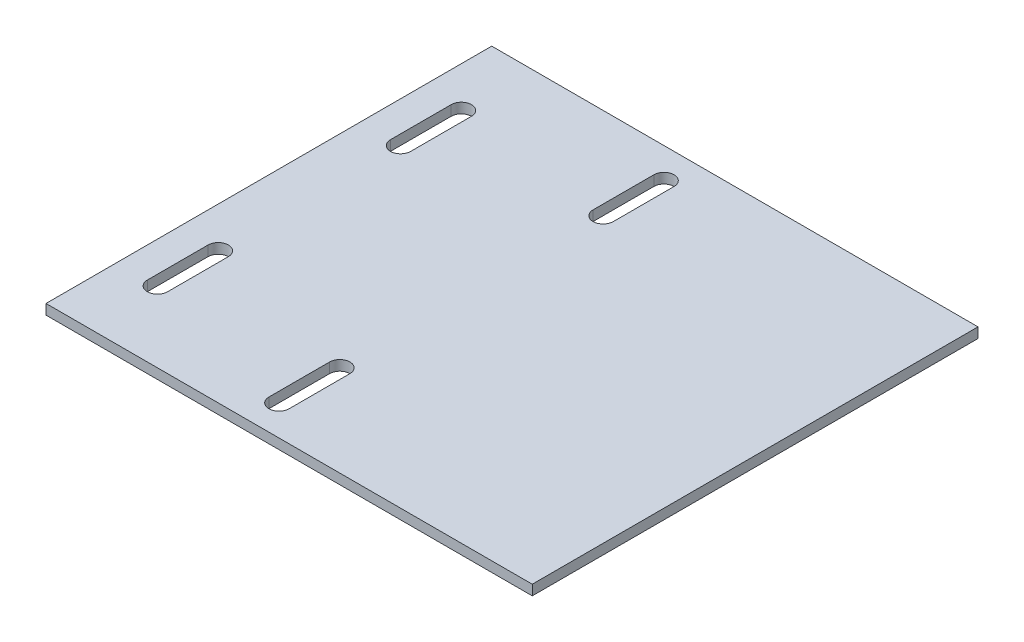
ISO-10303-21;
HEADER;
FILE_DESCRIPTION(('STEP AP214'),'2;1');
FILE_NAME('part.step','',(''),(''),'','','');
FILE_SCHEMA(('AUTOMOTIVE_DESIGN { 1 0 10303 214 1 1 1 1 }'));
ENDSEC;
DATA;
#1=APPLICATION_CONTEXT('core data for automotive mechanical design processes');
#2=APPLICATION_PROTOCOL_DEFINITION('international standard','automotive_design',2000,#1);
#3=PRODUCT_CONTEXT('',#1,'mechanical');
#4=PRODUCT('Part','Part','',(#3));
#5=PRODUCT_RELATED_PRODUCT_CATEGORY('part','',(#4));
#6=PRODUCT_DEFINITION_FORMATION('','',#4);
#7=PRODUCT_DEFINITION_CONTEXT('part definition',#1,'design');
#8=PRODUCT_DEFINITION('design','',#6,#7);
#9=PRODUCT_DEFINITION_SHAPE('','',#8);
#10=(LENGTH_UNIT() NAMED_UNIT(*) SI_UNIT(.MILLI.,.METRE.));
#11=(NAMED_UNIT(*) PLANE_ANGLE_UNIT() SI_UNIT($,.RADIAN.));
#12=(NAMED_UNIT(*) SI_UNIT($,.STERADIAN.) SOLID_ANGLE_UNIT());
#13=UNCERTAINTY_MEASURE_WITH_UNIT(LENGTH_MEASURE(1.E-05),#10,'distance_accuracy_value','');
#14=(GEOMETRIC_REPRESENTATION_CONTEXT(3) GLOBAL_UNCERTAINTY_ASSIGNED_CONTEXT((#13)) GLOBAL_UNIT_ASSIGNED_CONTEXT((#10,
#11,#12)) REPRESENTATION_CONTEXT('',''));
#15=CARTESIAN_POINT('',(0.,0.,0.));
#16=DIRECTION('',(0.,0.,1.));
#17=DIRECTION('',(1.,0.,0.));
#18=AXIS2_PLACEMENT_3D('',#15,#16,#17);
#19=CARTESIAN_POINT('',(-76.2,3.175,-69.85));
#20=DIRECTION('',(1.,0.,0.));
#21=DIRECTION('',(0.,0.,-1.));
#22=AXIS2_PLACEMENT_3D('',#19,#20,#21);
#23=PLANE('',#22);
#24=DIRECTION('',(0.,0.,1.));
#25=VECTOR('',#24,1.);
#26=CARTESIAN_POINT('',(-76.2,0.,-69.85));
#27=LINE('',#26,#25);
#28=CARTESIAN_POINT('',(-76.2,0.,-69.85));
#29=VERTEX_POINT('',#28);
#30=CARTESIAN_POINT('',(-76.2,0.,69.85));
#31=VERTEX_POINT('',#30);
#32=EDGE_CURVE('E298',#29,#31,#27,.T.);
#33=ORIENTED_EDGE('',*,*,#32,.T.);
#34=DIRECTION('',(0.,-1.,0.));
#35=VECTOR('',#34,1.);
#36=CARTESIAN_POINT('',(-76.2,3.175,69.85));
#37=LINE('',#36,#35);
#38=CARTESIAN_POINT('',(-76.2,3.175,69.85));
#39=VERTEX_POINT('',#38);
#40=EDGE_CURVE('E11',#39,#31,#37,.T.);
#41=ORIENTED_EDGE('',*,*,#40,.F.);
#42=DIRECTION('',(0.,0.,1.));
#43=VECTOR('',#42,1.);
#44=CARTESIAN_POINT('',(-76.2,3.175,-69.85));
#45=LINE('',#44,#43);
#46=CARTESIAN_POINT('',(-76.2,3.175,-69.85));
#47=VERTEX_POINT('',#46);
#48=EDGE_CURVE('E305',#47,#39,#45,.T.);
#49=ORIENTED_EDGE('',*,*,#48,.F.);
#50=DIRECTION('',(0.,-1.,0.));
#51=VECTOR('',#50,1.);
#52=CARTESIAN_POINT('',(-76.2,3.175,-69.85));
#53=LINE('',#52,#51);
#54=EDGE_CURVE('E316',#47,#29,#53,.T.);
#55=ORIENTED_EDGE('',*,*,#54,.T.);
#56=EDGE_LOOP('',(#33,#41,#49,#55));
#57=FACE_BOUND('',#56,.T.);
#58=ADVANCED_FACE('F37',(#57),#23,.F.);
#59=CARTESIAN_POINT('',(76.2,3.175,69.85));
#60=DIRECTION('',(0.,0.,-1.));
#61=DIRECTION('',(-1.,0.,0.));
#62=AXIS2_PLACEMENT_3D('',#59,#60,#61);
#63=PLANE('',#62);
#64=DIRECTION('',(1.,0.,0.));
#65=VECTOR('',#64,1.);
#66=CARTESIAN_POINT('',(76.2,0.,69.85));
#67=LINE('',#66,#65);
#68=CARTESIAN_POINT('',(76.2,0.,69.85));
#69=VERTEX_POINT('',#68);
#70=EDGE_CURVE('E319',#31,#69,#67,.T.);
#71=ORIENTED_EDGE('',*,*,#70,.T.);
#72=DIRECTION('',(0.,-1.,0.));
#73=VECTOR('',#72,1.);
#74=CARTESIAN_POINT('',(76.2,3.175,69.85));
#75=LINE('',#74,#73);
#76=CARTESIAN_POINT('',(76.2,3.175,69.85));
#77=VERTEX_POINT('',#76);
#78=EDGE_CURVE('E44',#77,#69,#75,.T.);
#79=ORIENTED_EDGE('',*,*,#78,.F.);
#80=DIRECTION('',(1.,0.,0.));
#81=VECTOR('',#80,1.);
#82=CARTESIAN_POINT('',(76.2,3.175,69.85));
#83=LINE('',#82,#81);
#84=EDGE_CURVE('E308',#39,#77,#83,.T.);
#85=ORIENTED_EDGE('',*,*,#84,.F.);
#86=ORIENTED_EDGE('',*,*,#40,.T.);
#87=EDGE_LOOP('',(#71,#79,#85,#86));
#88=FACE_BOUND('',#87,.T.);
#89=ADVANCED_FACE('F349',(#88),#63,.F.);
#90=CARTESIAN_POINT('',(76.2,3.175,-69.85));
#91=DIRECTION('',(-1.,0.,0.));
#92=DIRECTION('',(0.,0.,1.));
#93=AXIS2_PLACEMENT_3D('',#90,#91,#92);
#94=PLANE('',#93);
#95=DIRECTION('',(0.,0.,-1.));
#96=VECTOR('',#95,1.);
#97=CARTESIAN_POINT('',(76.2,0.,-69.85));
#98=LINE('',#97,#96);
#99=CARTESIAN_POINT('',(76.2,0.,-69.85));
#100=VERTEX_POINT('',#99);
#101=EDGE_CURVE('E322',#69,#100,#98,.T.);
#102=ORIENTED_EDGE('',*,*,#101,.T.);
#103=DIRECTION('',(0.,-1.,0.));
#104=VECTOR('',#103,1.);
#105=CARTESIAN_POINT('',(76.2,3.175,-69.85));
#106=LINE('',#105,#104);
#107=CARTESIAN_POINT('',(76.2,3.175,-69.85));
#108=VERTEX_POINT('',#107);
#109=EDGE_CURVE('E327',#108,#100,#106,.T.);
#110=ORIENTED_EDGE('',*,*,#109,.F.);
#111=DIRECTION('',(0.,0.,-1.));
#112=VECTOR('',#111,1.);
#113=CARTESIAN_POINT('',(76.2,3.175,-69.85));
#114=LINE('',#113,#112);
#115=EDGE_CURVE('E312',#77,#108,#114,.T.);
#116=ORIENTED_EDGE('',*,*,#115,.F.);
#117=ORIENTED_EDGE('',*,*,#78,.T.);
#118=EDGE_LOOP('',(#102,#110,#116,#117));
#119=FACE_BOUND('',#118,.T.);
#120=ADVANCED_FACE('F334',(#119),#94,.F.);
#121=CARTESIAN_POINT('',(76.2,3.175,-69.85));
#122=DIRECTION('',(0.,0.,1.));
#123=DIRECTION('',(1.,0.,0.));
#124=AXIS2_PLACEMENT_3D('',#121,#122,#123);
#125=PLANE('',#124);
#126=DIRECTION('',(-1.,0.,0.));
#127=VECTOR('',#126,1.);
#128=CARTESIAN_POINT('',(76.2,0.,-69.85));
#129=LINE('',#128,#127);
#130=EDGE_CURVE('E309',#100,#29,#129,.T.);
#131=ORIENTED_EDGE('',*,*,#130,.T.);
#132=ORIENTED_EDGE('',*,*,#54,.F.);
#133=DIRECTION('',(-1.,0.,0.));
#134=VECTOR('',#133,1.);
#135=CARTESIAN_POINT('',(76.2,3.175,-69.85));
#136=LINE('',#135,#134);
#137=EDGE_CURVE('E314',#108,#47,#136,.T.);
#138=ORIENTED_EDGE('',*,*,#137,.F.);
#139=ORIENTED_EDGE('',*,*,#109,.T.);
#140=EDGE_LOOP('',(#131,#132,#138,#139));
#141=FACE_BOUND('',#140,.T.);
#142=ADVANCED_FACE('F342',(#141),#125,.F.);
#143=CARTESIAN_POINT('',(-76.1999999999999,3.175,69.85));
#144=DIRECTION('',(0.,-1.,0.));
#145=DIRECTION('',(0.,0.,-1.));
#146=AXIS2_PLACEMENT_3D('',#143,#144,#145);
#147=PLANE('',#146);
#148=CARTESIAN_POINT('',(-63.5,3.175,-28.575));
#149=DIRECTION('',(0.,1.,0.));
#150=DIRECTION('',(0.,0.,1.));
#151=AXIS2_PLACEMENT_3D('',#148,#149,#150);
#152=CIRCLE('',#151,3.175);
#153=CARTESIAN_POINT('',(-66.675,3.175,-28.575));
#154=VERTEX_POINT('',#153);
#155=CARTESIAN_POINT('',(-60.325,3.175,-28.575));
#156=VERTEX_POINT('',#155);
#157=EDGE_CURVE('E199',#154,#156,#152,.T.);
#158=ORIENTED_EDGE('',*,*,#157,.F.);
#159=DIRECTION('',(0.,0.,1.));
#160=VECTOR('',#159,1.);
#161=CARTESIAN_POINT('',(-66.675,3.175,0.));
#162=LINE('',#161,#160);
#163=CARTESIAN_POINT('',(-66.675,3.175,-47.625));
#164=VERTEX_POINT('',#163);
#165=EDGE_CURVE('E51',#164,#154,#162,.T.);
#166=ORIENTED_EDGE('',*,*,#165,.F.);
#167=CARTESIAN_POINT('',(-63.5,3.175,-47.625));
#168=DIRECTION('',(0.,1.,0.));
#169=DIRECTION('',(0.,0.,1.));
#170=AXIS2_PLACEMENT_3D('',#167,#168,#169);
#171=CIRCLE('',#170,3.17499999999999);
#172=CARTESIAN_POINT('',(-60.325,3.175,-47.625));
#173=VERTEX_POINT('',#172);
#174=EDGE_CURVE('E190',#173,#164,#171,.T.);
#175=ORIENTED_EDGE('',*,*,#174,.F.);
#176=DIRECTION('',(0.,0.,1.));
#177=VECTOR('',#176,1.);
#178=CARTESIAN_POINT('',(-60.325,3.175,0.));
#179=LINE('',#178,#177);
#180=EDGE_CURVE('E193',#173,#156,#179,.T.);
#181=ORIENTED_EDGE('',*,*,#180,.T.);
#182=EDGE_LOOP('',(#158,#166,#175,#181));
#183=FACE_BOUND('',#182,.T.);
#184=CARTESIAN_POINT('',(-63.5,3.175,47.625));
#185=DIRECTION('',(0.,1.,0.));
#186=DIRECTION('',(0.,0.,1.));
#187=AXIS2_PLACEMENT_3D('',#184,#185,#186);
#188=CIRCLE('',#187,3.175);
#189=CARTESIAN_POINT('',(-66.675,3.175,47.625));
#190=VERTEX_POINT('',#189);
#191=CARTESIAN_POINT('',(-60.325,3.175,47.625));
#192=VERTEX_POINT('',#191);
#193=EDGE_CURVE('E224',#190,#192,#188,.T.);
#194=ORIENTED_EDGE('',*,*,#193,.F.);
#195=DIRECTION('',(0.,0.,1.));
#196=VECTOR('',#195,1.);
#197=CARTESIAN_POINT('',(-66.675,3.175,0.));
#198=LINE('',#197,#196);
#199=CARTESIAN_POINT('',(-66.675,3.175,28.575));
#200=VERTEX_POINT('',#199);
#201=EDGE_CURVE('E205',#200,#190,#198,.T.);
#202=ORIENTED_EDGE('',*,*,#201,.F.);
#203=CARTESIAN_POINT('',(-63.5,3.175,28.575));
#204=DIRECTION('',(0.,1.,0.));
#205=DIRECTION('',(0.,0.,1.));
#206=AXIS2_PLACEMENT_3D('',#203,#204,#205);
#207=CIRCLE('',#206,3.175);
#208=CARTESIAN_POINT('',(-60.325,3.175,28.575));
#209=VERTEX_POINT('',#208);
#210=EDGE_CURVE('E213',#209,#200,#207,.T.);
#211=ORIENTED_EDGE('',*,*,#210,.F.);
#212=DIRECTION('',(0.,0.,1.));
#213=VECTOR('',#212,1.);
#214=CARTESIAN_POINT('',(-60.325,3.175,0.));
#215=LINE('',#214,#213);
#216=EDGE_CURVE('E227',#209,#192,#215,.T.);
#217=ORIENTED_EDGE('',*,*,#216,.T.);
#218=EDGE_LOOP('',(#194,#202,#211,#217));
#219=FACE_BOUND('',#218,.T.);
#220=CARTESIAN_POINT('',(-12.7,3.175,-60.325));
#221=DIRECTION('',(0.,1.,0.));
#222=DIRECTION('',(0.,0.,1.));
#223=AXIS2_PLACEMENT_3D('',#220,#221,#222);
#224=CIRCLE('',#223,3.175);
#225=CARTESIAN_POINT('',(-9.52500000000001,3.175,-60.325));
#226=VERTEX_POINT('',#225);
#227=CARTESIAN_POINT('',(-15.875,3.175,-60.325));
#228=VERTEX_POINT('',#227);
#229=EDGE_CURVE('E256',#226,#228,#224,.T.);
#230=ORIENTED_EDGE('',*,*,#229,.F.);
#231=DIRECTION('',(0.,0.,-1.));
#232=VECTOR('',#231,1.);
#233=CARTESIAN_POINT('',(-9.52500000000001,3.175,0.));
#234=LINE('',#233,#232);
#235=CARTESIAN_POINT('',(-9.52500000000001,3.175,-41.275));
#236=VERTEX_POINT('',#235);
#237=EDGE_CURVE('E234',#236,#226,#234,.T.);
#238=ORIENTED_EDGE('',*,*,#237,.F.);
#239=CARTESIAN_POINT('',(-12.7,3.175,-41.275));
#240=DIRECTION('',(0.,1.,0.));
#241=DIRECTION('',(0.,0.,1.));
#242=AXIS2_PLACEMENT_3D('',#239,#240,#241);
#243=CIRCLE('',#242,3.175);
#244=CARTESIAN_POINT('',(-15.875,3.175,-41.275));
#245=VERTEX_POINT('',#244);
#246=EDGE_CURVE('E245',#245,#236,#243,.T.);
#247=ORIENTED_EDGE('',*,*,#246,.F.);
#248=DIRECTION('',(0.,0.,-1.));
#249=VECTOR('',#248,1.);
#250=CARTESIAN_POINT('',(-15.875,3.175,0.));
#251=LINE('',#250,#249);
#252=EDGE_CURVE('E259',#245,#228,#251,.T.);
#253=ORIENTED_EDGE('',*,*,#252,.T.);
#254=EDGE_LOOP('',(#230,#238,#247,#253));
#255=FACE_BOUND('',#254,.T.);
#256=CARTESIAN_POINT('',(-12.7,3.175,60.325));
#257=DIRECTION('',(0.,1.,0.));
#258=DIRECTION('',(0.,0.,1.));
#259=AXIS2_PLACEMENT_3D('',#256,#257,#258);
#260=CIRCLE('',#259,3.175);
#261=CARTESIAN_POINT('',(-15.875,3.175,60.325));
#262=VERTEX_POINT('',#261);
#263=CARTESIAN_POINT('',(-9.52499999999999,3.175,60.325));
#264=VERTEX_POINT('',#263);
#265=EDGE_CURVE('E288',#262,#264,#260,.T.);
#266=ORIENTED_EDGE('',*,*,#265,.F.);
#267=DIRECTION('',(0.,0.,1.));
#268=VECTOR('',#267,1.);
#269=CARTESIAN_POINT('',(-15.875,3.175,0.));
#270=LINE('',#269,#268);
#271=CARTESIAN_POINT('',(-15.875,3.175,41.275));
#272=VERTEX_POINT('',#271);
#273=EDGE_CURVE('E266',#272,#262,#270,.T.);
#274=ORIENTED_EDGE('',*,*,#273,.F.);
#275=CARTESIAN_POINT('',(-12.7,3.175,41.275));
#276=DIRECTION('',(0.,1.,0.));
#277=DIRECTION('',(0.,0.,1.));
#278=AXIS2_PLACEMENT_3D('',#275,#276,#277);
#279=CIRCLE('',#278,3.175);
#280=CARTESIAN_POINT('',(-9.52499999999999,3.175,41.275));
#281=VERTEX_POINT('',#280);
#282=EDGE_CURVE('E277',#281,#272,#279,.T.);
#283=ORIENTED_EDGE('',*,*,#282,.F.);
#284=DIRECTION('',(0.,0.,1.));
#285=VECTOR('',#284,1.);
#286=CARTESIAN_POINT('',(-9.52500000000001,3.175,0.));
#287=LINE('',#286,#285);
#288=EDGE_CURVE('E291',#281,#264,#287,.T.);
#289=ORIENTED_EDGE('',*,*,#288,.T.);
#290=EDGE_LOOP('',(#266,#274,#283,#289));
#291=FACE_BOUND('',#290,.T.);
#292=ORIENTED_EDGE('',*,*,#48,.T.);
#293=ORIENTED_EDGE('',*,*,#84,.T.);
#294=ORIENTED_EDGE('',*,*,#115,.T.);
#295=ORIENTED_EDGE('',*,*,#137,.T.);
#296=EDGE_LOOP('',(#292,#293,#294,#295));
#297=FACE_BOUND('',#296,.T.);
#298=ADVANCED_FACE('F348',(#183,#219,#255,#291,#297),#147,.F.);
#299=CARTESIAN_POINT('',(-76.1999999999999,0.,69.85));
#300=DIRECTION('',(0.,-1.,0.));
#301=DIRECTION('',(0.,0.,-1.));
#302=AXIS2_PLACEMENT_3D('',#299,#300,#301);
#303=PLANE('',#302);
#304=DIRECTION('',(0.,0.,1.));
#305=VECTOR('',#304,1.);
#306=CARTESIAN_POINT('',(-66.675,0.,0.));
#307=LINE('',#306,#305);
#308=CARTESIAN_POINT('',(-66.675,0.,-47.625));
#309=VERTEX_POINT('',#308);
#310=CARTESIAN_POINT('',(-66.675,0.,-28.575));
#311=VERTEX_POINT('',#310);
#312=EDGE_CURVE('E175',#309,#311,#307,.T.);
#313=ORIENTED_EDGE('',*,*,#312,.T.);
#314=CARTESIAN_POINT('',(-63.5,0.,-28.575));
#315=DIRECTION('',(0.,1.,0.));
#316=DIRECTION('',(0.,0.,1.));
#317=AXIS2_PLACEMENT_3D('',#314,#315,#316);
#318=CIRCLE('',#317,3.175);
#319=CARTESIAN_POINT('',(-60.325,0.,-28.575));
#320=VERTEX_POINT('',#319);
#321=EDGE_CURVE('E181',#311,#320,#318,.T.);
#322=ORIENTED_EDGE('',*,*,#321,.T.);
#323=DIRECTION('',(0.,0.,1.));
#324=VECTOR('',#323,1.);
#325=CARTESIAN_POINT('',(-60.325,0.,0.));
#326=LINE('',#325,#324);
#327=CARTESIAN_POINT('',(-60.325,0.,-47.625));
#328=VERTEX_POINT('',#327);
#329=EDGE_CURVE('E185',#328,#320,#326,.T.);
#330=ORIENTED_EDGE('',*,*,#329,.F.);
#331=CARTESIAN_POINT('',(-63.5,0.,-47.625));
#332=DIRECTION('',(0.,1.,0.));
#333=DIRECTION('',(0.,0.,1.));
#334=AXIS2_PLACEMENT_3D('',#331,#332,#333);
#335=CIRCLE('',#334,3.17499999999999);
#336=EDGE_CURVE('E178',#328,#309,#335,.T.);
#337=ORIENTED_EDGE('',*,*,#336,.T.);
#338=EDGE_LOOP('',(#313,#322,#330,#337));
#339=FACE_BOUND('',#338,.T.);
#340=DIRECTION('',(0.,0.,1.));
#341=VECTOR('',#340,1.);
#342=CARTESIAN_POINT('',(-66.675,0.,0.));
#343=LINE('',#342,#341);
#344=CARTESIAN_POINT('',(-66.675,0.,28.575));
#345=VERTEX_POINT('',#344);
#346=CARTESIAN_POINT('',(-66.675,0.,47.625));
#347=VERTEX_POINT('',#346);
#348=EDGE_CURVE('E209',#345,#347,#343,.T.);
#349=ORIENTED_EDGE('',*,*,#348,.T.);
#350=CARTESIAN_POINT('',(-63.5,0.,47.625));
#351=DIRECTION('',(0.,1.,0.));
#352=DIRECTION('',(0.,0.,1.));
#353=AXIS2_PLACEMENT_3D('',#350,#351,#352);
#354=CIRCLE('',#353,3.175);
#355=CARTESIAN_POINT('',(-60.325,0.,47.625));
#356=VERTEX_POINT('',#355);
#357=EDGE_CURVE('E212',#347,#356,#354,.T.);
#358=ORIENTED_EDGE('',*,*,#357,.T.);
#359=DIRECTION('',(0.,0.,1.));
#360=VECTOR('',#359,1.);
#361=CARTESIAN_POINT('',(-60.325,0.,0.));
#362=LINE('',#361,#360);
#363=CARTESIAN_POINT('',(-60.325,0.,28.575));
#364=VERTEX_POINT('',#363);
#365=EDGE_CURVE('E216',#364,#356,#362,.T.);
#366=ORIENTED_EDGE('',*,*,#365,.F.);
#367=CARTESIAN_POINT('',(-63.5,0.,28.575));
#368=DIRECTION('',(0.,1.,0.));
#369=DIRECTION('',(0.,0.,1.));
#370=AXIS2_PLACEMENT_3D('',#367,#368,#369);
#371=CIRCLE('',#370,3.175);
#372=EDGE_CURVE('E219',#364,#345,#371,.T.);
#373=ORIENTED_EDGE('',*,*,#372,.T.);
#374=EDGE_LOOP('',(#349,#358,#366,#373));
#375=FACE_BOUND('',#374,.T.);
#376=DIRECTION('',(0.,0.,-1.));
#377=VECTOR('',#376,1.);
#378=CARTESIAN_POINT('',(-9.52500000000001,0.,0.));
#379=LINE('',#378,#377);
#380=CARTESIAN_POINT('',(-9.52500000000001,0.,-41.275));
#381=VERTEX_POINT('',#380);
#382=CARTESIAN_POINT('',(-9.52500000000002,0.,-60.325));
#383=VERTEX_POINT('',#382);
#384=EDGE_CURVE('E241',#381,#383,#379,.T.);
#385=ORIENTED_EDGE('',*,*,#384,.T.);
#386=CARTESIAN_POINT('',(-12.7,0.,-60.325));
#387=DIRECTION('',(0.,1.,0.));
#388=DIRECTION('',(0.,0.,1.));
#389=AXIS2_PLACEMENT_3D('',#386,#387,#388);
#390=CIRCLE('',#389,3.175);
#391=CARTESIAN_POINT('',(-15.875,0.,-60.325));
#392=VERTEX_POINT('',#391);
#393=EDGE_CURVE('E244',#383,#392,#390,.T.);
#394=ORIENTED_EDGE('',*,*,#393,.T.);
#395=DIRECTION('',(0.,0.,-1.));
#396=VECTOR('',#395,1.);
#397=CARTESIAN_POINT('',(-15.875,0.,0.));
#398=LINE('',#397,#396);
#399=CARTESIAN_POINT('',(-15.875,0.,-41.275));
#400=VERTEX_POINT('',#399);
#401=EDGE_CURVE('E248',#400,#392,#398,.T.);
#402=ORIENTED_EDGE('',*,*,#401,.F.);
#403=CARTESIAN_POINT('',(-12.7,0.,-41.275));
#404=DIRECTION('',(0.,1.,0.));
#405=DIRECTION('',(0.,0.,1.));
#406=AXIS2_PLACEMENT_3D('',#403,#404,#405);
#407=CIRCLE('',#406,3.175);
#408=EDGE_CURVE('E251',#400,#381,#407,.T.);
#409=ORIENTED_EDGE('',*,*,#408,.T.);
#410=EDGE_LOOP('',(#385,#394,#402,#409));
#411=FACE_BOUND('',#410,.T.);
#412=DIRECTION('',(0.,0.,1.));
#413=VECTOR('',#412,1.);
#414=CARTESIAN_POINT('',(-15.875,0.,0.));
#415=LINE('',#414,#413);
#416=CARTESIAN_POINT('',(-15.875,0.,41.275));
#417=VERTEX_POINT('',#416);
#418=CARTESIAN_POINT('',(-15.875,0.,60.325));
#419=VERTEX_POINT('',#418);
#420=EDGE_CURVE('E273',#417,#419,#415,.T.);
#421=ORIENTED_EDGE('',*,*,#420,.T.);
#422=CARTESIAN_POINT('',(-12.7,0.,60.325));
#423=DIRECTION('',(0.,1.,0.));
#424=DIRECTION('',(0.,0.,1.));
#425=AXIS2_PLACEMENT_3D('',#422,#423,#424);
#426=CIRCLE('',#425,3.175);
#427=CARTESIAN_POINT('',(-9.525,0.,60.325));
#428=VERTEX_POINT('',#427);
#429=EDGE_CURVE('E276',#419,#428,#426,.T.);
#430=ORIENTED_EDGE('',*,*,#429,.T.);
#431=DIRECTION('',(0.,0.,1.));
#432=VECTOR('',#431,1.);
#433=CARTESIAN_POINT('',(-9.52500000000001,0.,0.));
#434=LINE('',#433,#432);
#435=CARTESIAN_POINT('',(-9.52499999999999,0.,41.275));
#436=VERTEX_POINT('',#435);
#437=EDGE_CURVE('E280',#436,#428,#434,.T.);
#438=ORIENTED_EDGE('',*,*,#437,.F.);
#439=CARTESIAN_POINT('',(-12.7,0.,41.275));
#440=DIRECTION('',(0.,1.,0.));
#441=DIRECTION('',(0.,0.,1.));
#442=AXIS2_PLACEMENT_3D('',#439,#440,#441);
#443=CIRCLE('',#442,3.175);
#444=EDGE_CURVE('E283',#436,#417,#443,.T.);
#445=ORIENTED_EDGE('',*,*,#444,.T.);
#446=EDGE_LOOP('',(#421,#430,#438,#445));
#447=FACE_BOUND('',#446,.T.);
#448=ORIENTED_EDGE('',*,*,#32,.F.);
#449=ORIENTED_EDGE('',*,*,#130,.F.);
#450=ORIENTED_EDGE('',*,*,#101,.F.);
#451=ORIENTED_EDGE('',*,*,#70,.F.);
#452=EDGE_LOOP('',(#448,#449,#450,#451));
#453=FACE_BOUND('',#452,.T.);
#454=ADVANCED_FACE('F187',(#339,#375,#411,#447,#453),#303,.T.);
#455=CARTESIAN_POINT('',(-15.875,0.,0.));
#456=DIRECTION('',(-1.,0.,0.));
#457=DIRECTION('',(0.,0.,1.));
#458=AXIS2_PLACEMENT_3D('',#455,#456,#457);
#459=PLANE('',#458);
#460=ORIENTED_EDGE('',*,*,#273,.T.);
#461=DIRECTION('',(0.,1.,0.));
#462=VECTOR('',#461,1.);
#463=CARTESIAN_POINT('',(-15.875,0.,60.325));
#464=LINE('',#463,#462);
#465=EDGE_CURVE('E286',#419,#262,#464,.T.);
#466=ORIENTED_EDGE('',*,*,#465,.F.);
#467=ORIENTED_EDGE('',*,*,#420,.F.);
#468=DIRECTION('',(0.,1.,0.));
#469=VECTOR('',#468,1.);
#470=CARTESIAN_POINT('',(-15.875,0.,41.275));
#471=LINE('',#470,#469);
#472=EDGE_CURVE('E296',#417,#272,#471,.T.);
#473=ORIENTED_EDGE('',*,*,#472,.T.);
#474=EDGE_LOOP('',(#460,#466,#467,#473));
#475=FACE_BOUND('',#474,.T.);
#476=ADVANCED_FACE('F361',(#475),#459,.F.);
#477=CARTESIAN_POINT('',(-12.7,0.,41.275));
#478=DIRECTION('',(0.,1.,0.));
#479=DIRECTION('',(0.,0.,1.));
#480=AXIS2_PLACEMENT_3D('',#477,#478,#479);
#481=CYLINDRICAL_SURFACE('',#480,3.175);
#482=ORIENTED_EDGE('',*,*,#282,.T.);
#483=ORIENTED_EDGE('',*,*,#472,.F.);
#484=ORIENTED_EDGE('',*,*,#444,.F.);
#485=DIRECTION('',(0.,1.,0.));
#486=VECTOR('',#485,1.);
#487=CARTESIAN_POINT('',(-9.52499999999999,0.,41.275));
#488=LINE('',#487,#486);
#489=EDGE_CURVE('E299',#436,#281,#488,.T.);
#490=ORIENTED_EDGE('',*,*,#489,.T.);
#491=EDGE_LOOP('',(#482,#483,#484,#490));
#492=FACE_BOUND('',#491,.T.);
#493=ADVANCED_FACE('F367',(#492),#481,.F.);
#494=CARTESIAN_POINT('',(-9.52500000000001,0.,0.));
#495=DIRECTION('',(-1.,0.,0.));
#496=DIRECTION('',(0.,0.,1.));
#497=AXIS2_PLACEMENT_3D('',#494,#495,#496);
#498=PLANE('',#497);
#499=ORIENTED_EDGE('',*,*,#288,.F.);
#500=ORIENTED_EDGE('',*,*,#489,.F.);
#501=ORIENTED_EDGE('',*,*,#437,.T.);
#502=DIRECTION('',(0.,1.,0.));
#503=VECTOR('',#502,1.);
#504=CARTESIAN_POINT('',(-9.52499999999999,0.,60.325));
#505=LINE('',#504,#503);
#506=EDGE_CURVE('E301',#428,#264,#505,.T.);
#507=ORIENTED_EDGE('',*,*,#506,.T.);
#508=EDGE_LOOP('',(#499,#500,#501,#507));
#509=FACE_BOUND('',#508,.T.);
#510=ADVANCED_FACE('F373',(#509),#498,.T.);
#511=CARTESIAN_POINT('',(-12.7,0.,60.325));
#512=DIRECTION('',(0.,1.,0.));
#513=DIRECTION('',(0.,0.,1.));
#514=AXIS2_PLACEMENT_3D('',#511,#512,#513);
#515=CYLINDRICAL_SURFACE('',#514,3.175);
#516=ORIENTED_EDGE('',*,*,#265,.T.);
#517=ORIENTED_EDGE('',*,*,#506,.F.);
#518=ORIENTED_EDGE('',*,*,#429,.F.);
#519=ORIENTED_EDGE('',*,*,#465,.T.);
#520=EDGE_LOOP('',(#516,#517,#518,#519));
#521=FACE_BOUND('',#520,.T.);
#522=ADVANCED_FACE('F369',(#521),#515,.F.);
#523=CARTESIAN_POINT('',(-9.52500000000001,0.,0.));
#524=DIRECTION('',(1.,0.,0.));
#525=DIRECTION('',(0.,0.,-1.));
#526=AXIS2_PLACEMENT_3D('',#523,#524,#525);
#527=PLANE('',#526);
#528=ORIENTED_EDGE('',*,*,#237,.T.);
#529=DIRECTION('',(0.,1.,0.));
#530=VECTOR('',#529,1.);
#531=CARTESIAN_POINT('',(-9.52500000000002,0.,-60.325));
#532=LINE('',#531,#530);
#533=EDGE_CURVE('E254',#383,#226,#532,.T.);
#534=ORIENTED_EDGE('',*,*,#533,.F.);
#535=ORIENTED_EDGE('',*,*,#384,.F.);
#536=DIRECTION('',(0.,1.,0.));
#537=VECTOR('',#536,1.);
#538=CARTESIAN_POINT('',(-9.52500000000001,0.,-41.275));
#539=LINE('',#538,#537);
#540=EDGE_CURVE('E264',#381,#236,#539,.T.);
#541=ORIENTED_EDGE('',*,*,#540,.T.);
#542=EDGE_LOOP('',(#528,#534,#535,#541));
#543=FACE_BOUND('',#542,.T.);
#544=ADVANCED_FACE('F372',(#543),#527,.F.);
#545=CARTESIAN_POINT('',(-12.7,0.,-41.275));
#546=DIRECTION('',(0.,1.,0.));
#547=DIRECTION('',(0.,0.,1.));
#548=AXIS2_PLACEMENT_3D('',#545,#546,#547);
#549=CYLINDRICAL_SURFACE('',#548,3.175);
#550=ORIENTED_EDGE('',*,*,#246,.T.);
#551=ORIENTED_EDGE('',*,*,#540,.F.);
#552=ORIENTED_EDGE('',*,*,#408,.F.);
#553=DIRECTION('',(0.,1.,0.));
#554=VECTOR('',#553,1.);
#555=CARTESIAN_POINT('',(-15.875,0.,-41.275));
#556=LINE('',#555,#554);
#557=EDGE_CURVE('E267',#400,#245,#556,.T.);
#558=ORIENTED_EDGE('',*,*,#557,.T.);
#559=EDGE_LOOP('',(#550,#551,#552,#558));
#560=FACE_BOUND('',#559,.T.);
#561=ADVANCED_FACE('F383',(#560),#549,.F.);
#562=CARTESIAN_POINT('',(-15.875,0.,0.));
#563=DIRECTION('',(1.,0.,0.));
#564=DIRECTION('',(0.,0.,-1.));
#565=AXIS2_PLACEMENT_3D('',#562,#563,#564);
#566=PLANE('',#565);
#567=ORIENTED_EDGE('',*,*,#252,.F.);
#568=ORIENTED_EDGE('',*,*,#557,.F.);
#569=ORIENTED_EDGE('',*,*,#401,.T.);
#570=DIRECTION('',(0.,1.,0.));
#571=VECTOR('',#570,1.);
#572=CARTESIAN_POINT('',(-15.875,0.,-60.325));
#573=LINE('',#572,#571);
#574=EDGE_CURVE('E269',#392,#228,#573,.T.);
#575=ORIENTED_EDGE('',*,*,#574,.T.);
#576=EDGE_LOOP('',(#567,#568,#569,#575));
#577=FACE_BOUND('',#576,.T.);
#578=ADVANCED_FACE('F389',(#577),#566,.T.);
#579=CARTESIAN_POINT('',(-12.7,0.,-60.325));
#580=DIRECTION('',(0.,1.,0.));
#581=DIRECTION('',(0.,0.,1.));
#582=AXIS2_PLACEMENT_3D('',#579,#580,#581);
#583=CYLINDRICAL_SURFACE('',#582,3.175);
#584=ORIENTED_EDGE('',*,*,#229,.T.);
#585=ORIENTED_EDGE('',*,*,#574,.F.);
#586=ORIENTED_EDGE('',*,*,#393,.F.);
#587=ORIENTED_EDGE('',*,*,#533,.T.);
#588=EDGE_LOOP('',(#584,#585,#586,#587));
#589=FACE_BOUND('',#588,.T.);
#590=ADVANCED_FACE('F385',(#589),#583,.F.);
#591=CARTESIAN_POINT('',(-66.675,0.,0.));
#592=DIRECTION('',(-1.,0.,0.));
#593=DIRECTION('',(0.,0.,1.));
#594=AXIS2_PLACEMENT_3D('',#591,#592,#593);
#595=PLANE('',#594);
#596=ORIENTED_EDGE('',*,*,#201,.T.);
#597=DIRECTION('',(0.,1.,0.));
#598=VECTOR('',#597,1.);
#599=CARTESIAN_POINT('',(-66.675,0.,47.625));
#600=LINE('',#599,#598);
#601=EDGE_CURVE('E222',#347,#190,#600,.T.);
#602=ORIENTED_EDGE('',*,*,#601,.F.);
#603=ORIENTED_EDGE('',*,*,#348,.F.);
#604=DIRECTION('',(0.,1.,0.));
#605=VECTOR('',#604,1.);
#606=CARTESIAN_POINT('',(-66.675,0.,28.575));
#607=LINE('',#606,#605);
#608=EDGE_CURVE('E232',#345,#200,#607,.T.);
#609=ORIENTED_EDGE('',*,*,#608,.T.);
#610=EDGE_LOOP('',(#596,#602,#603,#609));
#611=FACE_BOUND('',#610,.T.);
#612=ADVANCED_FACE('F388',(#611),#595,.F.);
#613=CARTESIAN_POINT('',(-63.5,0.,28.575));
#614=DIRECTION('',(0.,1.,0.));
#615=DIRECTION('',(0.,0.,1.));
#616=AXIS2_PLACEMENT_3D('',#613,#614,#615);
#617=CYLINDRICAL_SURFACE('',#616,3.175);
#618=ORIENTED_EDGE('',*,*,#210,.T.);
#619=ORIENTED_EDGE('',*,*,#608,.F.);
#620=ORIENTED_EDGE('',*,*,#372,.F.);
#621=DIRECTION('',(0.,1.,0.));
#622=VECTOR('',#621,1.);
#623=CARTESIAN_POINT('',(-60.325,0.,28.575));
#624=LINE('',#623,#622);
#625=EDGE_CURVE('E235',#364,#209,#624,.T.);
#626=ORIENTED_EDGE('',*,*,#625,.T.);
#627=EDGE_LOOP('',(#618,#619,#620,#626));
#628=FACE_BOUND('',#627,.T.);
#629=ADVANCED_FACE('F399',(#628),#617,.F.);
#630=CARTESIAN_POINT('',(-60.325,0.,0.));
#631=DIRECTION('',(-1.,0.,0.));
#632=DIRECTION('',(0.,0.,1.));
#633=AXIS2_PLACEMENT_3D('',#630,#631,#632);
#634=PLANE('',#633);
#635=ORIENTED_EDGE('',*,*,#216,.F.);
#636=ORIENTED_EDGE('',*,*,#625,.F.);
#637=ORIENTED_EDGE('',*,*,#365,.T.);
#638=DIRECTION('',(0.,1.,0.));
#639=VECTOR('',#638,1.);
#640=CARTESIAN_POINT('',(-60.325,0.,47.625));
#641=LINE('',#640,#639);
#642=EDGE_CURVE('E237',#356,#192,#641,.T.);
#643=ORIENTED_EDGE('',*,*,#642,.T.);
#644=EDGE_LOOP('',(#635,#636,#637,#643));
#645=FACE_BOUND('',#644,.T.);
#646=ADVANCED_FACE('F404',(#645),#634,.T.);
#647=CARTESIAN_POINT('',(-63.5,0.,47.625));
#648=DIRECTION('',(0.,1.,0.));
#649=DIRECTION('',(0.,0.,1.));
#650=AXIS2_PLACEMENT_3D('',#647,#648,#649);
#651=CYLINDRICAL_SURFACE('',#650,3.175);
#652=ORIENTED_EDGE('',*,*,#193,.T.);
#653=ORIENTED_EDGE('',*,*,#642,.F.);
#654=ORIENTED_EDGE('',*,*,#357,.F.);
#655=ORIENTED_EDGE('',*,*,#601,.T.);
#656=EDGE_LOOP('',(#652,#653,#654,#655));
#657=FACE_BOUND('',#656,.T.);
#658=ADVANCED_FACE('F401',(#657),#651,.F.);
#659=CARTESIAN_POINT('',(-66.675,0.,0.));
#660=DIRECTION('',(-1.,0.,0.));
#661=DIRECTION('',(0.,0.,1.));
#662=AXIS2_PLACEMENT_3D('',#659,#660,#661);
#663=PLANE('',#662);
#664=ORIENTED_EDGE('',*,*,#165,.T.);
#665=DIRECTION('',(0.,1.,0.));
#666=VECTOR('',#665,1.);
#667=CARTESIAN_POINT('',(-66.675,0.,-28.575));
#668=LINE('',#667,#666);
#669=EDGE_CURVE('E172',#311,#154,#668,.T.);
#670=ORIENTED_EDGE('',*,*,#669,.F.);
#671=ORIENTED_EDGE('',*,*,#312,.F.);
#672=DIRECTION('',(0.,1.,0.));
#673=VECTOR('',#672,1.);
#674=CARTESIAN_POINT('',(-66.675,0.,-47.625));
#675=LINE('',#674,#673);
#676=EDGE_CURVE('E203',#309,#164,#675,.T.);
#677=ORIENTED_EDGE('',*,*,#676,.T.);
#678=EDGE_LOOP('',(#664,#670,#671,#677));
#679=FACE_BOUND('',#678,.T.);
#680=ADVANCED_FACE('F173',(#679),#663,.F.);
#681=CARTESIAN_POINT('',(-63.5,0.,-47.625));
#682=DIRECTION('',(0.,1.,0.));
#683=DIRECTION('',(0.,0.,1.));
#684=AXIS2_PLACEMENT_3D('',#681,#682,#683);
#685=CYLINDRICAL_SURFACE('',#684,3.17499999999999);
#686=ORIENTED_EDGE('',*,*,#174,.T.);
#687=ORIENTED_EDGE('',*,*,#676,.F.);
#688=ORIENTED_EDGE('',*,*,#336,.F.);
#689=DIRECTION('',(0.,1.,0.));
#690=VECTOR('',#689,1.);
#691=CARTESIAN_POINT('',(-60.325,0.,-47.625));
#692=LINE('',#691,#690);
#693=EDGE_CURVE('E206',#328,#173,#692,.T.);
#694=ORIENTED_EDGE('',*,*,#693,.T.);
#695=EDGE_LOOP('',(#686,#687,#688,#694));
#696=FACE_BOUND('',#695,.T.);
#697=ADVANCED_FACE('F414',(#696),#685,.F.);
#698=CARTESIAN_POINT('',(-60.325,0.,0.));
#699=DIRECTION('',(-1.,0.,0.));
#700=DIRECTION('',(0.,0.,1.));
#701=AXIS2_PLACEMENT_3D('',#698,#699,#700);
#702=PLANE('',#701);
#703=ORIENTED_EDGE('',*,*,#180,.F.);
#704=ORIENTED_EDGE('',*,*,#693,.F.);
#705=ORIENTED_EDGE('',*,*,#329,.T.);
#706=DIRECTION('',(0.,1.,0.));
#707=VECTOR('',#706,1.);
#708=CARTESIAN_POINT('',(-60.325,0.,-28.575));
#709=LINE('',#708,#707);
#710=EDGE_CURVE('E59',#320,#156,#709,.T.);
#711=ORIENTED_EDGE('',*,*,#710,.T.);
#712=EDGE_LOOP('',(#703,#704,#705,#711));
#713=FACE_BOUND('',#712,.T.);
#714=ADVANCED_FACE('F417',(#713),#702,.T.);
#715=CARTESIAN_POINT('',(-63.5,0.,-28.575));
#716=DIRECTION('',(0.,1.,0.));
#717=DIRECTION('',(0.,0.,1.));
#718=AXIS2_PLACEMENT_3D('',#715,#716,#717);
#719=CYLINDRICAL_SURFACE('',#718,3.175);
#720=ORIENTED_EDGE('',*,*,#157,.T.);
#721=ORIENTED_EDGE('',*,*,#710,.F.);
#722=ORIENTED_EDGE('',*,*,#321,.F.);
#723=ORIENTED_EDGE('',*,*,#669,.T.);
#724=EDGE_LOOP('',(#720,#721,#722,#723));
#725=FACE_BOUND('',#724,.T.);
#726=ADVANCED_FACE('F182',(#725),#719,.F.);
#727=CLOSED_SHELL('',(#58,#89,#120,#142,#298,#454,#476,#493,#510,#522,#544,#561,#578,#590,#612,
#629,#646,#658,#680,#697,#714,#726));
#728=MANIFOLD_SOLID_BREP('B2',#727);
#729=ADVANCED_BREP_SHAPE_REPRESENTATION('',(#18,#728),#14);
#730=SHAPE_DEFINITION_REPRESENTATION(#9,#729);
ENDSEC;
END-ISO-10303-21;
